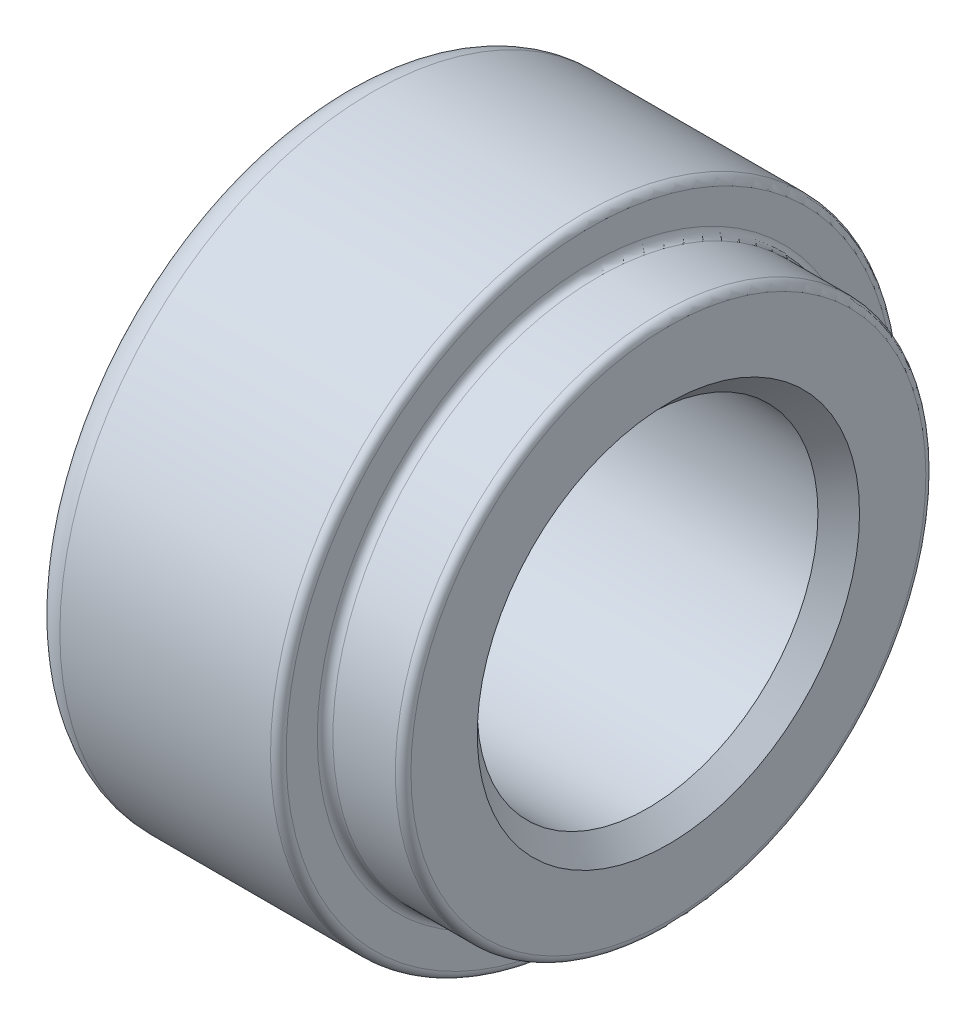
ISO-10303-21;
HEADER;
FILE_DESCRIPTION(('STEP AP214'),'2;1');
FILE_NAME('part.step','',(''),(''),'','','');
FILE_SCHEMA(('AUTOMOTIVE_DESIGN { 1 0 10303 214 1 1 1 1 }'));
ENDSEC;
DATA;
#1=APPLICATION_CONTEXT('core data for automotive mechanical design processes');
#2=APPLICATION_PROTOCOL_DEFINITION('international standard','automotive_design',2000,#1);
#3=PRODUCT_CONTEXT('',#1,'mechanical');
#4=PRODUCT('Part','Part','',(#3));
#5=PRODUCT_RELATED_PRODUCT_CATEGORY('part','',(#4));
#6=PRODUCT_DEFINITION_FORMATION('','',#4);
#7=PRODUCT_DEFINITION_CONTEXT('part definition',#1,'design');
#8=PRODUCT_DEFINITION('design','',#6,#7);
#9=PRODUCT_DEFINITION_SHAPE('','',#8);
#10=(LENGTH_UNIT() NAMED_UNIT(*) SI_UNIT(.MILLI.,.METRE.));
#11=(NAMED_UNIT(*) PLANE_ANGLE_UNIT() SI_UNIT($,.RADIAN.));
#12=(NAMED_UNIT(*) SI_UNIT($,.STERADIAN.) SOLID_ANGLE_UNIT());
#13=UNCERTAINTY_MEASURE_WITH_UNIT(LENGTH_MEASURE(1.E-05),#10,'distance_accuracy_value','');
#14=(GEOMETRIC_REPRESENTATION_CONTEXT(3) GLOBAL_UNCERTAINTY_ASSIGNED_CONTEXT((#13)) GLOBAL_UNIT_ASSIGNED_CONTEXT((#10,
#11,#12)) REPRESENTATION_CONTEXT('',''));
#15=CARTESIAN_POINT('',(0.,0.,0.));
#16=DIRECTION('',(0.,0.,1.));
#17=DIRECTION('',(1.,0.,0.));
#18=AXIS2_PLACEMENT_3D('',#15,#16,#17);
#19=CARTESIAN_POINT('',(-19.,0.,0.));
#20=DIRECTION('',(1.,0.,0.));
#21=DIRECTION('',(0.,0.,-1.));
#22=AXIS2_PLACEMENT_3D('',#19,#20,#21);
#23=TOROIDAL_SURFACE('',#22,18.,2.);
#24=CARTESIAN_POINT('',(-21.,0.,0.));
#25=DIRECTION('',(1.,0.,0.));
#26=DIRECTION('',(0.,0.,-1.));
#27=AXIS2_PLACEMENT_3D('',#24,#25,#26);
#28=CIRCLE('',#27,18.);
#29=CARTESIAN_POINT('',(-21.,0.,-18.));
#30=VERTEX_POINT('',#29);
#31=EDGE_CURVE('E10',#30,#30,#28,.T.);
#32=ORIENTED_EDGE('',*,*,#31,.T.);
#33=EDGE_LOOP('',(#32));
#34=FACE_BOUND('',#33,.T.);
#35=CARTESIAN_POINT('',(-19.,0.,0.));
#36=DIRECTION('',(1.,0.,0.));
#37=DIRECTION('',(0.,0.,-1.));
#38=AXIS2_PLACEMENT_3D('',#35,#36,#37);
#39=CIRCLE('',#38,20.);
#40=CARTESIAN_POINT('',(-19.,0.,-20.));
#41=VERTEX_POINT('',#40);
#42=EDGE_CURVE('E83',#41,#41,#39,.T.);
#43=ORIENTED_EDGE('',*,*,#42,.F.);
#44=EDGE_LOOP('',(#43));
#45=FACE_BOUND('',#44,.T.);
#46=ADVANCED_FACE('F43',(#34,#45),#23,.T.);
#47=CARTESIAN_POINT('',(-21.,18.,0.));
#48=DIRECTION('',(-1.,0.,0.));
#49=DIRECTION('',(0.,0.,1.));
#50=AXIS2_PLACEMENT_3D('',#47,#48,#49);
#51=PLANE('',#50);
#52=CARTESIAN_POINT('',(-21.,0.,0.));
#53=DIRECTION('',(1.,0.,0.));
#54=DIRECTION('',(0.,0.,-1.));
#55=AXIS2_PLACEMENT_3D('',#52,#53,#54);
#56=CIRCLE('',#55,12.25);
#57=CARTESIAN_POINT('',(-21.,0.,-12.25));
#58=VERTEX_POINT('',#57);
#59=EDGE_CURVE('E49',#58,#58,#56,.T.);
#60=ORIENTED_EDGE('',*,*,#59,.T.);
#61=EDGE_LOOP('',(#60));
#62=FACE_BOUND('',#61,.T.);
#63=ORIENTED_EDGE('',*,*,#31,.F.);
#64=EDGE_LOOP('',(#63));
#65=FACE_BOUND('',#64,.T.);
#66=ADVANCED_FACE('F91',(#62,#65),#51,.T.);
#67=CARTESIAN_POINT('',(-21.,0.,0.));
#68=DIRECTION('',(-1.,0.,0.));
#69=DIRECTION('',(0.,0.,1.));
#70=AXIS2_PLACEMENT_3D('',#67,#68,#69);
#71=CONICAL_SURFACE('',#70,12.25,0.785398163397451);
#72=CARTESIAN_POINT('',(-19.6675,0.,0.));
#73=DIRECTION('',(1.,0.,0.));
#74=DIRECTION('',(0.,0.,-1.));
#75=AXIS2_PLACEMENT_3D('',#72,#73,#74);
#76=CIRCLE('',#75,10.9175);
#77=CARTESIAN_POINT('',(-19.6675,0.,-10.9175));
#78=VERTEX_POINT('',#77);
#79=EDGE_CURVE('E53',#78,#78,#76,.T.);
#80=ORIENTED_EDGE('',*,*,#79,.T.);
#81=EDGE_LOOP('',(#80));
#82=FACE_BOUND('',#81,.T.);
#83=ORIENTED_EDGE('',*,*,#59,.F.);
#84=EDGE_LOOP('',(#83));
#85=FACE_BOUND('',#84,.T.);
#86=ADVANCED_FACE('F95',(#82,#85),#71,.F.);
#87=CARTESIAN_POINT('',(0.,0.,0.));
#88=DIRECTION('',(1.,0.,0.));
#89=DIRECTION('',(0.,0.,-1.));
#90=AXIS2_PLACEMENT_3D('',#87,#88,#89);
#91=CYLINDRICAL_SURFACE('',#90,10.9175);
#92=CARTESIAN_POINT('',(-1.3325,0.,0.));
#93=DIRECTION('',(1.,0.,0.));
#94=DIRECTION('',(0.,0.,-1.));
#95=AXIS2_PLACEMENT_3D('',#92,#93,#94);
#96=CIRCLE('',#95,10.9175);
#97=CARTESIAN_POINT('',(-1.3325,0.,-10.9175));
#98=VERTEX_POINT('',#97);
#99=EDGE_CURVE('E57',#98,#98,#96,.T.);
#100=ORIENTED_EDGE('',*,*,#99,.T.);
#101=EDGE_LOOP('',(#100));
#102=FACE_BOUND('',#101,.T.);
#103=ORIENTED_EDGE('',*,*,#79,.F.);
#104=EDGE_LOOP('',(#103));
#105=FACE_BOUND('',#104,.T.);
#106=ADVANCED_FACE('F99',(#102,#105),#91,.F.);
#107=CARTESIAN_POINT('',(-1.3325,0.,0.));
#108=DIRECTION('',(1.,0.,0.));
#109=DIRECTION('',(0.,0.,-1.));
#110=AXIS2_PLACEMENT_3D('',#107,#108,#109);
#111=CONICAL_SURFACE('',#110,10.9175,0.78539816339745);
#112=CARTESIAN_POINT('',(0.,0.,0.));
#113=DIRECTION('',(1.,0.,0.));
#114=DIRECTION('',(0.,0.,-1.));
#115=AXIS2_PLACEMENT_3D('',#112,#113,#114);
#116=CIRCLE('',#115,12.25);
#117=CARTESIAN_POINT('',(0.,0.,-12.25));
#118=VERTEX_POINT('',#117);
#119=EDGE_CURVE('E62',#118,#118,#116,.T.);
#120=ORIENTED_EDGE('',*,*,#119,.T.);
#121=EDGE_LOOP('',(#120));
#122=FACE_BOUND('',#121,.T.);
#123=ORIENTED_EDGE('',*,*,#99,.F.);
#124=EDGE_LOOP('',(#123));
#125=FACE_BOUND('',#124,.T.);
#126=ADVANCED_FACE('F106',(#122,#125),#111,.F.);
#127=CARTESIAN_POINT('',(0.,12.25,0.));
#128=DIRECTION('',(1.,0.,0.));
#129=DIRECTION('',(0.,0.,-1.));
#130=AXIS2_PLACEMENT_3D('',#127,#128,#129);
#131=PLANE('',#130);
#132=CARTESIAN_POINT('',(0.,0.,0.));
#133=DIRECTION('',(1.,0.,0.));
#134=DIRECTION('',(0.,0.,-1.));
#135=AXIS2_PLACEMENT_3D('',#132,#133,#134);
#136=CIRCLE('',#135,16.5);
#137=CARTESIAN_POINT('',(0.,0.,-16.5));
#138=VERTEX_POINT('',#137);
#139=EDGE_CURVE('E65',#138,#138,#136,.T.);
#140=ORIENTED_EDGE('',*,*,#139,.T.);
#141=EDGE_LOOP('',(#140));
#142=FACE_BOUND('',#141,.T.);
#143=ORIENTED_EDGE('',*,*,#119,.F.);
#144=EDGE_LOOP('',(#143));
#145=FACE_BOUND('',#144,.T.);
#146=ADVANCED_FACE('F110',(#142,#145),#131,.T.);
#147=CARTESIAN_POINT('',(-0.5,0.,0.));
#148=DIRECTION('',(1.,0.,0.));
#149=DIRECTION('',(0.,0.,-1.));
#150=AXIS2_PLACEMENT_3D('',#147,#148,#149);
#151=TOROIDAL_SURFACE('',#150,16.5,0.5);
#152=CARTESIAN_POINT('',(-0.5,0.,0.));
#153=DIRECTION('',(1.,0.,0.));
#154=DIRECTION('',(0.,0.,-1.));
#155=AXIS2_PLACEMENT_3D('',#152,#153,#154);
#156=CIRCLE('',#155,17.);
#157=CARTESIAN_POINT('',(-0.5,0.,-17.));
#158=VERTEX_POINT('',#157);
#159=EDGE_CURVE('E68',#158,#158,#156,.T.);
#160=ORIENTED_EDGE('',*,*,#159,.T.);
#161=EDGE_LOOP('',(#160));
#162=FACE_BOUND('',#161,.T.);
#163=ORIENTED_EDGE('',*,*,#139,.F.);
#164=EDGE_LOOP('',(#163));
#165=FACE_BOUND('',#164,.T.);
#166=ADVANCED_FACE('F114',(#162,#165),#151,.T.);
#167=CARTESIAN_POINT('',(0.,0.,0.));
#168=DIRECTION('',(1.,0.,0.));
#169=DIRECTION('',(0.,0.,-1.));
#170=AXIS2_PLACEMENT_3D('',#167,#168,#169);
#171=CYLINDRICAL_SURFACE('',#170,17.);
#172=CARTESIAN_POINT('',(-4.5,0.,0.));
#173=DIRECTION('',(1.,0.,0.));
#174=DIRECTION('',(0.,0.,-1.));
#175=AXIS2_PLACEMENT_3D('',#172,#173,#174);
#176=CIRCLE('',#175,17.);
#177=CARTESIAN_POINT('',(-4.5,0.,-17.));
#178=VERTEX_POINT('',#177);
#179=EDGE_CURVE('E71',#178,#178,#176,.T.);
#180=ORIENTED_EDGE('',*,*,#179,.T.);
#181=EDGE_LOOP('',(#180));
#182=FACE_BOUND('',#181,.T.);
#183=ORIENTED_EDGE('',*,*,#159,.F.);
#184=EDGE_LOOP('',(#183));
#185=FACE_BOUND('',#184,.T.);
#186=ADVANCED_FACE('F118',(#182,#185),#171,.T.);
#187=CARTESIAN_POINT('',(-4.5,0.,0.));
#188=DIRECTION('',(1.,0.,0.));
#189=DIRECTION('',(0.,0.,-1.));
#190=AXIS2_PLACEMENT_3D('',#187,#188,#189);
#191=TOROIDAL_SURFACE('',#190,17.5,0.5);
#192=CARTESIAN_POINT('',(-5.,0.,0.));
#193=DIRECTION('',(1.,0.,0.));
#194=DIRECTION('',(0.,0.,-1.));
#195=AXIS2_PLACEMENT_3D('',#192,#193,#194);
#196=CIRCLE('',#195,17.5);
#197=CARTESIAN_POINT('',(-5.,0.,-17.5));
#198=VERTEX_POINT('',#197);
#199=EDGE_CURVE('E74',#198,#198,#196,.T.);
#200=ORIENTED_EDGE('',*,*,#199,.T.);
#201=EDGE_LOOP('',(#200));
#202=FACE_BOUND('',#201,.T.);
#203=ORIENTED_EDGE('',*,*,#179,.F.);
#204=EDGE_LOOP('',(#203));
#205=FACE_BOUND('',#204,.T.);
#206=ADVANCED_FACE('F122',(#202,#205),#191,.F.);
#207=CARTESIAN_POINT('',(-5.,17.5,0.));
#208=DIRECTION('',(1.,0.,0.));
#209=DIRECTION('',(0.,0.,-1.));
#210=AXIS2_PLACEMENT_3D('',#207,#208,#209);
#211=PLANE('',#210);
#212=CARTESIAN_POINT('',(-5.,0.,0.));
#213=DIRECTION('',(1.,0.,0.));
#214=DIRECTION('',(0.,0.,-1.));
#215=AXIS2_PLACEMENT_3D('',#212,#213,#214);
#216=CIRCLE('',#215,19.5);
#217=CARTESIAN_POINT('',(-5.,0.,-19.5));
#218=VERTEX_POINT('',#217);
#219=EDGE_CURVE('E77',#218,#218,#216,.T.);
#220=ORIENTED_EDGE('',*,*,#219,.T.);
#221=EDGE_LOOP('',(#220));
#222=FACE_BOUND('',#221,.T.);
#223=ORIENTED_EDGE('',*,*,#199,.F.);
#224=EDGE_LOOP('',(#223));
#225=FACE_BOUND('',#224,.T.);
#226=ADVANCED_FACE('F126',(#222,#225),#211,.T.);
#227=CARTESIAN_POINT('',(-5.5,0.,0.));
#228=DIRECTION('',(1.,0.,0.));
#229=DIRECTION('',(0.,0.,-1.));
#230=AXIS2_PLACEMENT_3D('',#227,#228,#229);
#231=TOROIDAL_SURFACE('',#230,19.5,0.5);
#232=CARTESIAN_POINT('',(-5.5,0.,0.));
#233=DIRECTION('',(1.,0.,0.));
#234=DIRECTION('',(0.,0.,-1.));
#235=AXIS2_PLACEMENT_3D('',#232,#233,#234);
#236=CIRCLE('',#235,20.);
#237=CARTESIAN_POINT('',(-5.5,0.,-20.));
#238=VERTEX_POINT('',#237);
#239=EDGE_CURVE('E80',#238,#238,#236,.T.);
#240=ORIENTED_EDGE('',*,*,#239,.T.);
#241=EDGE_LOOP('',(#240));
#242=FACE_BOUND('',#241,.T.);
#243=ORIENTED_EDGE('',*,*,#219,.F.);
#244=EDGE_LOOP('',(#243));
#245=FACE_BOUND('',#244,.T.);
#246=ADVANCED_FACE('F130',(#242,#245),#231,.T.);
#247=CARTESIAN_POINT('',(0.,0.,0.));
#248=DIRECTION('',(1.,0.,0.));
#249=DIRECTION('',(0.,0.,-1.));
#250=AXIS2_PLACEMENT_3D('',#247,#248,#249);
#251=CYLINDRICAL_SURFACE('',#250,20.);
#252=ORIENTED_EDGE('',*,*,#42,.T.);
#253=EDGE_LOOP('',(#252));
#254=FACE_BOUND('',#253,.T.);
#255=ORIENTED_EDGE('',*,*,#239,.F.);
#256=EDGE_LOOP('',(#255));
#257=FACE_BOUND('',#256,.T.);
#258=ADVANCED_FACE('F87',(#254,#257),#251,.T.);
#259=CLOSED_SHELL('',(#46,#66,#86,#106,#126,#146,#166,#186,#206,#226,#246,#258));
#260=MANIFOLD_SOLID_BREP('B2',#259);
#261=ADVANCED_BREP_SHAPE_REPRESENTATION('',(#18,#260),#14);
#262=SHAPE_DEFINITION_REPRESENTATION(#9,#261);
ENDSEC;
END-ISO-10303-21;
